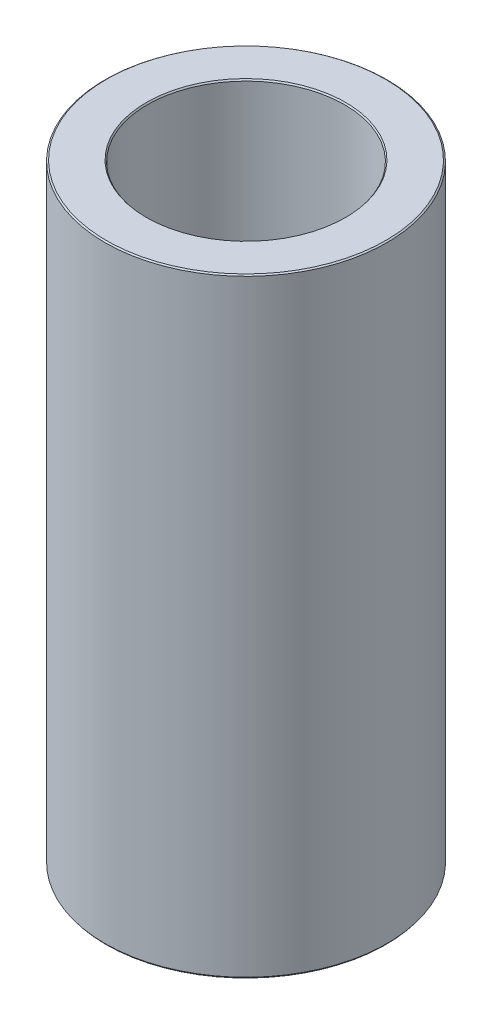
ISO-10303-21;
HEADER;
FILE_DESCRIPTION(('STEP AP214'),'2;1');
FILE_NAME('part.step','',(''),(''),'','','');
FILE_SCHEMA(('AUTOMOTIVE_DESIGN { 1 0 10303 214 1 1 1 1 }'));
ENDSEC;
DATA;
#1=APPLICATION_CONTEXT('core data for automotive mechanical design processes');
#2=APPLICATION_PROTOCOL_DEFINITION('international standard','automotive_design',2000,#1);
#3=PRODUCT_CONTEXT('',#1,'mechanical');
#4=PRODUCT('Part','Part','',(#3));
#5=PRODUCT_RELATED_PRODUCT_CATEGORY('part','',(#4));
#6=PRODUCT_DEFINITION_FORMATION('','',#4);
#7=PRODUCT_DEFINITION_CONTEXT('part definition',#1,'design');
#8=PRODUCT_DEFINITION('design','',#6,#7);
#9=PRODUCT_DEFINITION_SHAPE('','',#8);
#10=(LENGTH_UNIT() NAMED_UNIT(*) SI_UNIT(.MILLI.,.METRE.));
#11=(NAMED_UNIT(*) PLANE_ANGLE_UNIT() SI_UNIT($,.RADIAN.));
#12=(NAMED_UNIT(*) SI_UNIT($,.STERADIAN.) SOLID_ANGLE_UNIT());
#13=UNCERTAINTY_MEASURE_WITH_UNIT(LENGTH_MEASURE(1.E-05),#10,'distance_accuracy_value','');
#14=(GEOMETRIC_REPRESENTATION_CONTEXT(3) GLOBAL_UNCERTAINTY_ASSIGNED_CONTEXT((#13)) GLOBAL_UNIT_ASSIGNED_CONTEXT((#10,
#11,#12)) REPRESENTATION_CONTEXT('',''));
#15=CARTESIAN_POINT('',(0.,0.,0.));
#16=DIRECTION('',(0.,0.,1.));
#17=DIRECTION('',(1.,0.,0.));
#18=AXIS2_PLACEMENT_3D('',#15,#16,#17);
#19=CARTESIAN_POINT('',(0.,183.632850368384,0.));
#20=DIRECTION('',(0.,-1.,0.));
#21=DIRECTION('',(0.,0.,-1.));
#22=AXIS2_PLACEMENT_3D('',#19,#20,#21);
#23=CYLINDRICAL_SURFACE('',#22,42.5);
#24=CARTESIAN_POINT('',(0.,0.430853037386214,0.));
#25=DIRECTION('',(0.,1.,0.));
#26=DIRECTION('',(0.,0.,1.));
#27=AXIS2_PLACEMENT_3D('',#24,#25,#26);
#28=CIRCLE('',#27,42.5);
#29=CARTESIAN_POINT('',(0.,0.430853037386214,-42.5));
#30=VERTEX_POINT('',#29);
#31=EDGE_CURVE('E10',#30,#30,#28,.T.);
#32=CARTESIAN_POINT('',(0.,183.311122167957,0.));
#33=DIRECTION('',(0.,1.,0.));
#34=DIRECTION('',(0.,0.,1.));
#35=AXIS2_PLACEMENT_3D('',#32,#33,#34);
#36=CIRCLE('',#35,42.5);
#37=CARTESIAN_POINT('',(0.,183.311122167957,-42.5));
#38=VERTEX_POINT('',#37);
#39=EDGE_CURVE('E50',#38,#38,#36,.F.);
#40=CARTESIAN_POINT('',(0.,0.430853037386214,-42.5));
#41=CARTESIAN_POINT('',(0.,2.33585584082965,-42.5));
#42=CARTESIAN_POINT('',(0.,4.24085864427309,-42.5));
#43=CARTESIAN_POINT('',(0.,8.05086425115998,-42.5));
#44=CARTESIAN_POINT('',(0.,9.95586705460343,-42.5));
#45=CARTESIAN_POINT('',(0.,13.7658726614903,-42.5));
#46=CARTESIAN_POINT('',(0.,15.6708754649338,-42.5));
#47=CARTESIAN_POINT('',(0.,19.4808810718206,-42.5));
#48=CARTESIAN_POINT('',(0.,21.3858838752641,-42.5));
#49=CARTESIAN_POINT('',(0.,25.195889482151,-42.5));
#50=CARTESIAN_POINT('',(0.,27.1008922855944,-42.5));
#51=CARTESIAN_POINT('',(0.,30.9108978924813,-42.5));
#52=CARTESIAN_POINT('',(0.,32.8159006959247,-42.5));
#53=CARTESIAN_POINT('',(0.,36.6259063028116,-42.5));
#54=CARTESIAN_POINT('',(0.,38.5309091062551,-42.5));
#55=CARTESIAN_POINT('',(0.,42.3409147131419,-42.5));
#56=CARTESIAN_POINT('',(0.,44.2459175165854,-42.5));
#57=CARTESIAN_POINT('',(0.,48.0559231234723,-42.5));
#58=CARTESIAN_POINT('',(0.,49.9609259269157,-42.5));
#59=CARTESIAN_POINT('',(0.,53.7709315338026,-42.5));
#60=CARTESIAN_POINT('',(0.,55.675934337246,-42.5));
#61=CARTESIAN_POINT('',(0.,59.4859399441329,-42.5));
#62=CARTESIAN_POINT('',(0.,61.3909427475764,-42.5));
#63=CARTESIAN_POINT('',(0.,65.2009483544633,-42.5));
#64=CARTESIAN_POINT('',(0.,67.1059511579067,-42.5));
#65=CARTESIAN_POINT('',(0.,70.9159567647936,-42.5));
#66=CARTESIAN_POINT('',(0.,72.820959568237,-42.5));
#67=CARTESIAN_POINT('',(0.,76.6309651751239,-42.5));
#68=CARTESIAN_POINT('',(0.,78.5359679785674,-42.5));
#69=CARTESIAN_POINT('',(0.,82.3459735854542,-42.5));
#70=CARTESIAN_POINT('',(0.,84.2509763888977,-42.5));
#71=CARTESIAN_POINT('',(0.,88.0609819957845,-42.5));
#72=CARTESIAN_POINT('',(0.,89.965984799228,-42.5));
#73=CARTESIAN_POINT('',(0.,93.7759904061149,-42.5));
#74=CARTESIAN_POINT('',(0.,95.6809932095583,-42.5));
#75=CARTESIAN_POINT('',(0.,99.4909988164452,-42.5));
#76=CARTESIAN_POINT('',(0.,101.396001619889,-42.5));
#77=CARTESIAN_POINT('',(0.,105.206007226776,-42.5));
#78=CARTESIAN_POINT('',(0.,107.111010030219,-42.5));
#79=CARTESIAN_POINT('',(0.,110.921015637106,-42.5));
#80=CARTESIAN_POINT('',(0.,112.826018440549,-42.5));
#81=CARTESIAN_POINT('',(0.,116.636024047436,-42.5));
#82=CARTESIAN_POINT('',(0.,118.54102685088,-42.5));
#83=CARTESIAN_POINT('',(0.,122.351032457767,-42.5));
#84=CARTESIAN_POINT('',(0.,124.25603526121,-42.5));
#85=CARTESIAN_POINT('',(0.,128.066040868097,-42.5));
#86=CARTESIAN_POINT('',(0.,129.97104367154,-42.5));
#87=CARTESIAN_POINT('',(0.,133.781049278427,-42.5));
#88=CARTESIAN_POINT('',(0.,135.686052081871,-42.5));
#89=CARTESIAN_POINT('',(0.,139.496057688758,-42.5));
#90=CARTESIAN_POINT('',(0.,141.401060492201,-42.5));
#91=CARTESIAN_POINT('',(0.,145.211066099088,-42.5));
#92=CARTESIAN_POINT('',(0.,147.116068902531,-42.5));
#93=CARTESIAN_POINT('',(0.,150.926074509418,-42.5));
#94=CARTESIAN_POINT('',(0.,152.831077312862,-42.5));
#95=CARTESIAN_POINT('',(0.,156.641082919748,-42.5));
#96=CARTESIAN_POINT('',(0.,158.546085723192,-42.5));
#97=CARTESIAN_POINT('',(0.,162.356091330079,-42.5));
#98=CARTESIAN_POINT('',(0.,164.261094133522,-42.5));
#99=CARTESIAN_POINT('',(0.,168.071099740409,-42.5));
#100=CARTESIAN_POINT('',(0.,169.976102543853,-42.5));
#101=CARTESIAN_POINT('',(0.,173.786108150739,-42.5));
#102=CARTESIAN_POINT('',(0.,175.691110954183,-42.5));
#103=CARTESIAN_POINT('',(0.,179.50111656107,-42.5));
#104=CARTESIAN_POINT('',(0.,181.406119364513,-42.5));
#105=CARTESIAN_POINT('',(0.,183.311122167957,-42.5));
#106=B_SPLINE_CURVE_WITH_KNOTS('',3,(#40,#41,#42,#43,#44,#45,#46,#47,#48,#49,#50,#51,#52,#53,
#54,#55,#56,#57,#58,#59,#60,#61,#62,#63,#64,#65,#66,#67,#68,#69,#70,#71,#72,#73,#74,#75,#76,#77,
#78,#79,#80,#81,#82,#83,#84,#85,#86,#87,#88,#89,#90,#91,#92,#93,#94,#95,#96,#97,#98,#99,#100,
#101,#102,#103,#104,#105),.UNSPECIFIED.,.F.,.F.,(4,2,2,2,2,2,2,2,2,2,2,2,2,2,2,2,2,2,2,2,2,2,2,
2,2,2,2,2,2,2,2,2,4),(0.,5.71500841033032,11.4300168206607,17.145025230991,22.8600336413213,
28.5750420516516,34.290050461982,40.0050588723123,45.7200672826426,51.435075692973,
57.1500841033033,62.8650925136336,68.5801009239639,74.2951093342942,80.0101177446246,
85.7251261549549,91.4401345652852,97.1551429756156,102.870151385946,108.585159796276,
114.300168206607,120.015176616937,125.730185027267,131.445193437598,137.160201847928,
142.875210258258,148.590218668588,154.305227078919,160.020235489249,165.735243899579,
171.45025230991,177.16526072024,182.88026913057),.UNSPECIFIED.);
#107=EDGE_CURVE('BSEAM39',#30,#38,#106,.T.);
#108=ORIENTED_EDGE('',*,*,#31,.T.);
#109=ORIENTED_EDGE('',*,*,#39,.T.);
#110=ORIENTED_EDGE('',*,*,#107,.T.);
#111=ORIENTED_EDGE('',*,*,#107,.F.);
#112=EDGE_LOOP('',(#108,#110,#109,#111));
#113=FACE_BOUND('',#112,.T.);
#114=ADVANCED_FACE('F39',(#113),#23,.T.);
#115=CARTESIAN_POINT('',(0.,183.632850368384,0.));
#116=DIRECTION('',(0.,1.,0.));
#117=DIRECTION('',(0.,0.,1.));
#118=AXIS2_PLACEMENT_3D('',#115,#116,#117);
#119=PLANE('',#118);
#120=CARTESIAN_POINT('',(0.,183.632850368384,0.));
#121=DIRECTION('',(0.,1.,0.));
#122=DIRECTION('',(0.,0.,1.));
#123=AXIS2_PLACEMENT_3D('',#120,#121,#122);
#124=CIRCLE('',#123,30.0311501186704);
#125=CARTESIAN_POINT('',(0.,183.632850368384,30.0311501186704));
#126=VERTEX_POINT('',#125);
#127=EDGE_CURVE('E58',#126,#126,#124,.F.);
#128=ORIENTED_EDGE('',*,*,#127,.T.);
#129=EDGE_LOOP('',(#128));
#130=FACE_BOUND('',#129,.T.);
#131=CARTESIAN_POINT('',(0.,183.632850368384,0.));
#132=DIRECTION('',(0.,1.,0.));
#133=DIRECTION('',(0.,0.,1.));
#134=AXIS2_PLACEMENT_3D('',#131,#132,#133);
#135=CIRCLE('',#134,42.0691469626142);
#136=CARTESIAN_POINT('',(0.,183.632850368384,-42.0691469626142));
#137=VERTEX_POINT('',#136);
#138=EDGE_CURVE('E61',#137,#137,#135,.T.);
#139=ORIENTED_EDGE('',*,*,#138,.T.);
#140=EDGE_LOOP('',(#139));
#141=FACE_BOUND('',#140,.T.);
#142=ADVANCED_FACE('F88',(#130,#141),#119,.T.);
#143=CARTESIAN_POINT('',(0.,0.,0.));
#144=DIRECTION('',(0.,1.,0.));
#145=DIRECTION('',(0.,0.,1.));
#146=AXIS2_PLACEMENT_3D('',#143,#144,#145);
#147=PLANE('',#146);
#148=CARTESIAN_POINT('',(0.,0.,0.));
#149=DIRECTION('',(0.,1.,0.));
#150=DIRECTION('',(0.,0.,1.));
#151=AXIS2_PLACEMENT_3D('',#148,#149,#150);
#152=CIRCLE('',#151,30.1402749556288);
#153=CARTESIAN_POINT('',(0.,0.,30.1402749556288));
#154=VERTEX_POINT('',#153);
#155=EDGE_CURVE('E51',#154,#154,#152,.T.);
#156=ORIENTED_EDGE('',*,*,#155,.T.);
#157=EDGE_LOOP('',(#156));
#158=FACE_BOUND('',#157,.T.);
#159=CARTESIAN_POINT('',(0.,0.,0.));
#160=DIRECTION('',(0.,1.,0.));
#161=DIRECTION('',(0.,0.,1.));
#162=AXIS2_PLACEMENT_3D('',#159,#160,#161);
#163=CIRCLE('',#162,42.1782717995724);
#164=CARTESIAN_POINT('',(0.,0.,42.1782717995724));
#165=VERTEX_POINT('',#164);
#166=EDGE_CURVE('E54',#165,#165,#163,.F.);
#167=ORIENTED_EDGE('',*,*,#166,.T.);
#168=EDGE_LOOP('',(#167));
#169=FACE_BOUND('',#168,.T.);
#170=ADVANCED_FACE('F83',(#158,#169),#147,.F.);
#171=CARTESIAN_POINT('',(0.,183.632850368384,0.));
#172=DIRECTION('',(0.,-1.,0.));
#173=DIRECTION('',(0.,0.,-1.));
#174=AXIS2_PLACEMENT_3D('',#171,#172,#173);
#175=CYLINDRICAL_SURFACE('',#174,29.7094219182429);
#176=CARTESIAN_POINT('',(0.,183.201997330998,0.));
#177=DIRECTION('',(0.,1.,0.));
#178=DIRECTION('',(0.,0.,1.));
#179=AXIS2_PLACEMENT_3D('',#176,#177,#178);
#180=CIRCLE('',#179,29.7094219182429);
#181=CARTESIAN_POINT('',(0.,183.201997330998,-29.7094219182429));
#182=VERTEX_POINT('',#181);
#183=EDGE_CURVE('E67',#182,#182,#180,.T.);
#184=CARTESIAN_POINT('',(0.,0.32172820042739,0.));
#185=DIRECTION('',(0.,1.,0.));
#186=DIRECTION('',(0.,0.,1.));
#187=AXIS2_PLACEMENT_3D('',#184,#185,#186);
#188=CIRCLE('',#187,29.7094219182429);
#189=CARTESIAN_POINT('',(0.,0.321728200427362,-29.7094219182429));
#190=VERTEX_POINT('',#189);
#191=EDGE_CURVE('E69',#190,#190,#188,.F.);
#192=CARTESIAN_POINT('',(0.,183.201997330998,-29.7094219182429));
#193=CARTESIAN_POINT('',(0.,181.296994527555,-29.7094219182429));
#194=CARTESIAN_POINT('',(0.,179.391991724111,-29.7094219182429));
#195=CARTESIAN_POINT('',(0.,175.581986117224,-29.7094219182429));
#196=CARTESIAN_POINT('',(0.,173.676983313781,-29.7094219182429));
#197=CARTESIAN_POINT('',(0.,169.866977706894,-29.7094219182429));
#198=CARTESIAN_POINT('',(0.,167.96197490345,-29.7094219182429));
#199=CARTESIAN_POINT('',(0.,164.151969296564,-29.7094219182429));
#200=CARTESIAN_POINT('',(0.,162.24696649312,-29.7094219182429));
#201=CARTESIAN_POINT('',(0.,158.436960886233,-29.7094219182429));
#202=CARTESIAN_POINT('',(0.,156.53195808279,-29.7094219182429));
#203=CARTESIAN_POINT('',(0.,152.721952475903,-29.7094219182429));
#204=CARTESIAN_POINT('',(0.,150.816949672459,-29.7094219182429));
#205=CARTESIAN_POINT('',(0.,147.006944065573,-29.7094219182429));
#206=CARTESIAN_POINT('',(0.,145.101941262129,-29.7094219182429));
#207=CARTESIAN_POINT('',(0.,141.291935655242,-29.7094219182429));
#208=CARTESIAN_POINT('',(0.,139.386932851799,-29.7094219182429));
#209=CARTESIAN_POINT('',(0.,135.576927244912,-29.7094219182429));
#210=CARTESIAN_POINT('',(0.,133.671924441468,-29.7094219182429));
#211=CARTESIAN_POINT('',(0.,129.861918834582,-29.7094219182429));
#212=CARTESIAN_POINT('',(0.,127.956916031138,-29.7094219182429));
#213=CARTESIAN_POINT('',(0.,124.146910424251,-29.7094219182429));
#214=CARTESIAN_POINT('',(0.,122.241907620808,-29.7094219182429));
#215=CARTESIAN_POINT('',(0.,118.431902013921,-29.7094219182429));
#216=CARTESIAN_POINT('',(0.,116.526899210477,-29.7094219182429));
#217=CARTESIAN_POINT('',(0.,112.716893603591,-29.7094219182429));
#218=CARTESIAN_POINT('',(0.,110.811890800147,-29.7094219182429));
#219=CARTESIAN_POINT('',(0.,107.00188519326,-29.7094219182429));
#220=CARTESIAN_POINT('',(0.,105.096882389817,-29.7094219182429));
#221=CARTESIAN_POINT('',(0.,101.28687678293,-29.7094219182429));
#222=CARTESIAN_POINT('',(0.,99.3818739794865,-29.7094219182429));
#223=CARTESIAN_POINT('',(0.,95.5718683725996,-29.7094219182429));
#224=CARTESIAN_POINT('',(0.,93.6668655691562,-29.7094219182429));
#225=CARTESIAN_POINT('',(0.,89.8568599622693,-29.7094219182429));
#226=CARTESIAN_POINT('',(0.,87.9518571588258,-29.7094219182429));
#227=CARTESIAN_POINT('',(0.,84.1418515519389,-29.7094219182429));
#228=CARTESIAN_POINT('',(0.,82.2368487484955,-29.7094219182429));
#229=CARTESIAN_POINT('',(0.,78.4268431416086,-29.7094219182429));
#230=CARTESIAN_POINT('',(0.,76.5218403381652,-29.7094219182429));
#231=CARTESIAN_POINT('',(0.,72.7118347312783,-29.7094219182429));
#232=CARTESIAN_POINT('',(0.,70.8068319278348,-29.7094219182429));
#233=CARTESIAN_POINT('',(0.,66.9968263209479,-29.7094219182429));
#234=CARTESIAN_POINT('',(0.,65.0918235175045,-29.7094219182429));
#235=CARTESIAN_POINT('',(0.,61.2818179106176,-29.7094219182429));
#236=CARTESIAN_POINT('',(0.,59.3768151071742,-29.7094219182429));
#237=CARTESIAN_POINT('',(0.,55.5668095002873,-29.7094219182429));
#238=CARTESIAN_POINT('',(0.,53.6618066968438,-29.7094219182429));
#239=CARTESIAN_POINT('',(0.,49.8518010899569,-29.7094219182429));
#240=CARTESIAN_POINT('',(0.,47.9467982865135,-29.7094219182429));
#241=CARTESIAN_POINT('',(0.,44.1367926796266,-29.7094219182429));
#242=CARTESIAN_POINT('',(0.,42.2317898761831,-29.7094219182429));
#243=CARTESIAN_POINT('',(0.,38.4217842692963,-29.7094219182429));
#244=CARTESIAN_POINT('',(0.,36.5167814658528,-29.7094219182429));
#245=CARTESIAN_POINT('',(0.,32.7067758589659,-29.7094219182429));
#246=CARTESIAN_POINT('',(0.,30.8017730555225,-29.7094219182429));
#247=CARTESIAN_POINT('',(0.,26.9917674486356,-29.7094219182429));
#248=CARTESIAN_POINT('',(0.,25.0867646451921,-29.7094219182429));
#249=CARTESIAN_POINT('',(0.,21.2767590383053,-29.7094219182429));
#250=CARTESIAN_POINT('',(0.,19.3717562348618,-29.7094219182429));
#251=CARTESIAN_POINT('',(0.,15.5617506279749,-29.7094219182429));
#252=CARTESIAN_POINT('',(0.,13.6567478245315,-29.7094219182429));
#253=CARTESIAN_POINT('',(0.,9.84674221764459,-29.7094219182429));
#254=CARTESIAN_POINT('',(0.,7.94173941420115,-29.7094219182429));
#255=CARTESIAN_POINT('',(0.,4.13173380731426,-29.7094219182429));
#256=CARTESIAN_POINT('',(0.,2.22673100387081,-29.7094219182429));
#257=CARTESIAN_POINT('',(0.,0.321728200427362,-29.7094219182429));
#258=B_SPLINE_CURVE_WITH_KNOTS('',3,(#192,#193,#194,#195,#196,#197,#198,#199,#200,#201,#202,
#203,#204,#205,#206,#207,#208,#209,#210,#211,#212,#213,#214,#215,#216,#217,#218,#219,#220,#221,
#222,#223,#224,#225,#226,#227,#228,#229,#230,#231,#232,#233,#234,#235,#236,#237,#238,#239,#240,
#241,#242,#243,#244,#245,#246,#247,#248,#249,#250,#251,#252,#253,#254,#255,#256,#257),
.UNSPECIFIED.,.F.,.F.,(4,2,2,2,2,2,2,2,2,2,2,2,2,2,2,2,2,2,2,2,2,2,2,2,2,2,2,2,2,2,2,2,4),(0.,
5.71500841033032,11.4300168206607,17.145025230991,22.8600336413213,28.5750420516516,
34.290050461982,40.0050588723123,45.7200672826427,51.435075692973,57.1500841033033,
62.8650925136336,68.580100923964,74.2951093342943,80.0101177446247,85.725126154955,
91.4401345652853,97.1551429756157,102.870151385946,108.585159796276,114.300168206607,
120.015176616937,125.730185027267,131.445193437598,137.160201847928,142.875210258258,
148.590218668589,154.305227078919,160.020235489249,165.73524389958,171.45025230991,
177.16526072024,182.880269130571),.UNSPECIFIED.);
#259=EDGE_CURVE('BSEAM71',#182,#190,#258,.T.);
#260=ORIENTED_EDGE('',*,*,#183,.T.);
#261=ORIENTED_EDGE('',*,*,#191,.T.);
#262=ORIENTED_EDGE('',*,*,#259,.T.);
#263=ORIENTED_EDGE('',*,*,#259,.F.);
#264=EDGE_LOOP('',(#260,#262,#261,#263));
#265=FACE_BOUND('',#264,.T.);
#266=ADVANCED_FACE('F71',(#265),#175,.F.);
#267=CARTESIAN_POINT('',(0.,183.201997330998,0.));
#268=DIRECTION('',(0.,1.,0.));
#269=DIRECTION('',(0.,0.,1.));
#270=AXIS2_PLACEMENT_3D('',#267,#268,#269);
#271=CONICAL_SURFACE('',#270,29.7094219182429,0.64140101619086);
#272=ORIENTED_EDGE('',*,*,#127,.F.);
#273=EDGE_LOOP('',(#272));
#274=FACE_BOUND('',#273,.T.);
#275=ORIENTED_EDGE('',*,*,#183,.F.);
#276=EDGE_LOOP('',(#275));
#277=FACE_BOUND('',#276,.T.);
#278=ADVANCED_FACE('F77',(#274,#277),#271,.F.);
#279=CARTESIAN_POINT('',(0.,0.,0.));
#280=DIRECTION('',(0.,-1.,0.));
#281=DIRECTION('',(0.,0.,-1.));
#282=AXIS2_PLACEMENT_3D('',#279,#280,#281);
#283=CONICAL_SURFACE('',#282,30.1402749556288,0.929395310604022);
#284=ORIENTED_EDGE('',*,*,#191,.F.);
#285=EDGE_LOOP('',(#284));
#286=FACE_BOUND('',#285,.T.);
#287=ORIENTED_EDGE('',*,*,#155,.F.);
#288=EDGE_LOOP('',(#287));
#289=FACE_BOUND('',#288,.T.);
#290=ADVANCED_FACE('F73',(#286,#289),#283,.F.);
#291=CARTESIAN_POINT('',(0.,0.430853037386186,0.));
#292=DIRECTION('',(0.,1.,0.));
#293=DIRECTION('',(0.,0.,1.));
#294=AXIS2_PLACEMENT_3D('',#291,#292,#293);
#295=CONICAL_SURFACE('',#294,42.5,0.641401016190876);
#296=ORIENTED_EDGE('',*,*,#166,.F.);
#297=EDGE_LOOP('',(#296));
#298=FACE_BOUND('',#297,.T.);
#299=ORIENTED_EDGE('',*,*,#31,.F.);
#300=EDGE_LOOP('',(#299));
#301=FACE_BOUND('',#300,.T.);
#302=ADVANCED_FACE('F76',(#298,#301),#295,.T.);
#303=CARTESIAN_POINT('',(0.,183.632850368384,0.));
#304=DIRECTION('',(0.,-1.,0.));
#305=DIRECTION('',(0.,0.,-1.));
#306=AXIS2_PLACEMENT_3D('',#303,#304,#305);
#307=CONICAL_SURFACE('',#306,42.0691469626142,0.929395310604009);
#308=CARTESIAN_POINT('',(0.,183.311122167957,-42.5));
#309=CARTESIAN_POINT('',(0.,183.314473503378,-42.4955119475273));
#310=CARTESIAN_POINT('',(0.,183.317824838799,-42.4910238950545));
#311=CARTESIAN_POINT('',(0.,183.324527509641,-42.4820477901089));
#312=CARTESIAN_POINT('',(0.,183.327878845062,-42.4775597376362));
#313=CARTESIAN_POINT('',(0.,183.334581515904,-42.4685836326906));
#314=CARTESIAN_POINT('',(0.,183.337932851326,-42.4640955802179));
#315=CARTESIAN_POINT('',(0.,183.344635522168,-42.4551194752723));
#316=CARTESIAN_POINT('',(0.,183.347986857589,-42.4506314227996));
#317=CARTESIAN_POINT('',(0.,183.354689528431,-42.441655317854));
#318=CARTESIAN_POINT('',(0.,183.358040863852,-42.4371672653813));
#319=CARTESIAN_POINT('',(0.,183.364743534695,-42.4281911604357));
#320=CARTESIAN_POINT('',(0.,183.368094870116,-42.423703107963));
#321=CARTESIAN_POINT('',(0.,183.374797540958,-42.4147270030174));
#322=CARTESIAN_POINT('',(0.,183.378148876379,-42.4102389505446));
#323=CARTESIAN_POINT('',(0.,183.384851547221,-42.4012628455991));
#324=CARTESIAN_POINT('',(0.,183.388202882642,-42.3967747931263));
#325=CARTESIAN_POINT('',(0.,183.394905553485,-42.3877986881808));
#326=CARTESIAN_POINT('',(0.,183.398256888906,-42.383310635708));
#327=CARTESIAN_POINT('',(0.,183.404959559748,-42.3743345307625));
#328=CARTESIAN_POINT('',(0.,183.408310895169,-42.3698464782897));
#329=CARTESIAN_POINT('',(0.,183.415013566011,-42.3608703733442));
#330=CARTESIAN_POINT('',(0.,183.418364901432,-42.3563823208714));
#331=CARTESIAN_POINT('',(0.,183.425067572275,-42.3474062159259));
#332=CARTESIAN_POINT('',(0.,183.428418907696,-42.3429181634531));
#333=CARTESIAN_POINT('',(0.,183.435121578538,-42.3339420585076));
#334=CARTESIAN_POINT('',(0.,183.438472913959,-42.3294540060348));
#335=CARTESIAN_POINT('',(0.,183.445175584801,-42.3204779010893));
#336=CARTESIAN_POINT('',(0.,183.448526920223,-42.3159898486165));
#337=CARTESIAN_POINT('',(0.,183.455229591065,-42.307013743671));
#338=CARTESIAN_POINT('',(0.,183.458580926486,-42.3025256911982));
#339=CARTESIAN_POINT('',(0.,183.465283597328,-42.2935495862527));
#340=CARTESIAN_POINT('',(0.,183.468634932749,-42.2890615337799));
#341=CARTESIAN_POINT('',(0.,183.475337603591,-42.2800854288343));
#342=CARTESIAN_POINT('',(0.,183.478688939013,-42.2755973763616));
#343=CARTESIAN_POINT('',(0.,183.485391609855,-42.266621271416));
#344=CARTESIAN_POINT('',(0.,183.488742945276,-42.2621332189433));
#345=CARTESIAN_POINT('',(0.,183.495445616118,-42.2531571139977));
#346=CARTESIAN_POINT('',(0.,183.498796951539,-42.248669061525));
#347=CARTESIAN_POINT('',(0.,183.505499622382,-42.2396929565794));
#348=CARTESIAN_POINT('',(0.,183.508850957803,-42.2352049041067));
#349=CARTESIAN_POINT('',(0.,183.515553628645,-42.2262287991611));
#350=CARTESIAN_POINT('',(0.,183.518904964066,-42.2217407466883));
#351=CARTESIAN_POINT('',(0.,183.525607634908,-42.2127646417428));
#352=CARTESIAN_POINT('',(0.,183.528958970329,-42.20827658927));
#353=CARTESIAN_POINT('',(0.,183.535661641172,-42.1993004843245));
#354=CARTESIAN_POINT('',(0.,183.539012976593,-42.1948124318517));
#355=CARTESIAN_POINT('',(0.,183.545715647435,-42.1858363269062));
#356=CARTESIAN_POINT('',(0.,183.549066982856,-42.1813482744334));
#357=CARTESIAN_POINT('',(0.,183.555769653698,-42.1723721694879));
#358=CARTESIAN_POINT('',(0.,183.559120989119,-42.1678841170151));
#359=CARTESIAN_POINT('',(0.,183.565823659962,-42.1589080120696));
#360=CARTESIAN_POINT('',(0.,183.569174995383,-42.1544199595968));
#361=CARTESIAN_POINT('',(0.,183.575877666225,-42.1454438546513));
#362=CARTESIAN_POINT('',(0.,183.579229001646,-42.1409558021785));
#363=CARTESIAN_POINT('',(0.,183.585931672488,-42.131979697233));
#364=CARTESIAN_POINT('',(0.,183.589283007909,-42.1274916447602));
#365=CARTESIAN_POINT('',(0.,183.595985678752,-42.1185155398147));
#366=CARTESIAN_POINT('',(0.,183.599337014173,-42.1140274873419));
#367=CARTESIAN_POINT('',(0.,183.606039685015,-42.1050513823963));
#368=CARTESIAN_POINT('',(0.,183.609391020436,-42.1005633299236));
#369=CARTESIAN_POINT('',(0.,183.616093691278,-42.091587224978));
#370=CARTESIAN_POINT('',(0.,183.6194450267,-42.0870991725053));
#371=CARTESIAN_POINT('',(0.,183.626147697542,-42.0781230675597));
#372=CARTESIAN_POINT('',(0.,183.629499032963,-42.073635015087));
#373=CARTESIAN_POINT('',(0.,183.632850368384,-42.0691469626142));
#374=B_SPLINE_CURVE_WITH_KNOTS('',3,(#308,#309,#310,#311,#312,#313,#314,#315,#316,#317,#318,
#319,#320,#321,#322,#323,#324,#325,#326,#327,#328,#329,#330,#331,#332,#333,#334,#335,#336,#337,
#338,#339,#340,#341,#342,#343,#344,#345,#346,#347,#348,#349,#350,#351,#352,#353,#354,#355,#356,
#357,#358,#359,#360,#361,#362,#363,#364,#365,#366,#367,#368,#369,#370,#371,#372,#373),
.UNSPECIFIED.,.F.,.F.,(4,2,2,2,2,2,2,2,2,2,2,2,2,2,2,2,2,2,2,2,2,2,2,2,2,2,2,2,2,2,2,2,4),(0.,
0.0168037667482092,0.0336075334964295,0.0504113002446498,0.0672150669928701,0.0840188337410959,
0.1008226004893,0.11762636723752,0.134430133985746,0.151233900733966,0.168037667482186,
0.18484143423039,0.201645200978616,0.218448967726836,0.235252734475056,0.252056501223282,
0.268860267971503,0.285664034719706,0.302467801467926,0.319271568216152,0.336075334964373,
0.352879101712593,0.369682868460802,0.386486635209022,0.403290401957243,0.420094168705463,
0.436897935453689,0.453701702201892,0.470505468950113,0.487309235698333,0.504113002446559,
0.520916769194779,0.537720535942999),.UNSPECIFIED.);
#375=EDGE_CURVE('BSEAM45',#38,#137,#374,.T.);
#376=ORIENTED_EDGE('',*,*,#39,.F.);
#377=ORIENTED_EDGE('',*,*,#138,.F.);
#378=ORIENTED_EDGE('',*,*,#375,.T.);
#379=ORIENTED_EDGE('',*,*,#375,.F.);
#380=EDGE_LOOP('',(#376,#378,#377,#379));
#381=FACE_BOUND('',#380,.T.);
#382=ADVANCED_FACE('F45',(#381),#307,.T.);
#383=CLOSED_SHELL('',(#114,#142,#170,#266,#278,#290,#302,#382));
#384=MANIFOLD_SOLID_BREP('B2',#383);
#385=ADVANCED_BREP_SHAPE_REPRESENTATION('',(#18,#384),#14);
#386=SHAPE_DEFINITION_REPRESENTATION(#9,#385);
ENDSEC;
END-ISO-10303-21;
